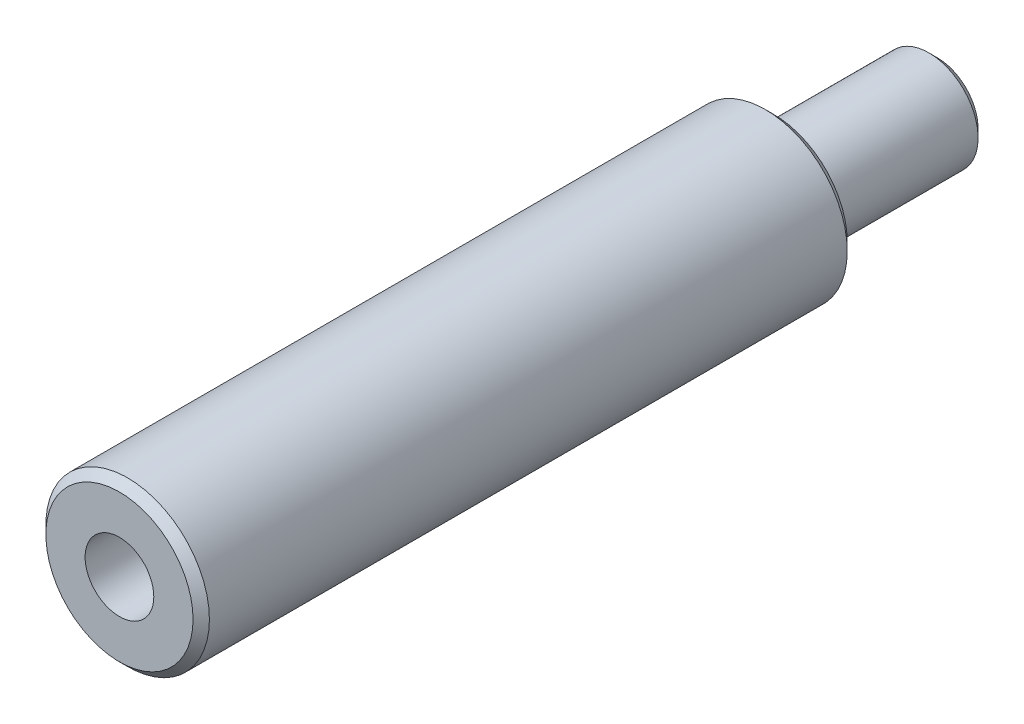
ISO-10303-21;
HEADER;
FILE_DESCRIPTION(('STEP AP214'),'2;1');
FILE_NAME('part.step','',(''),(''),'','','');
FILE_SCHEMA(('AUTOMOTIVE_DESIGN { 1 0 10303 214 1 1 1 1 }'));
ENDSEC;
DATA;
#1=APPLICATION_CONTEXT('core data for automotive mechanical design processes');
#2=APPLICATION_PROTOCOL_DEFINITION('international standard','automotive_design',2000,#1);
#3=PRODUCT_CONTEXT('',#1,'mechanical');
#4=PRODUCT('Part','Part','',(#3));
#5=PRODUCT_RELATED_PRODUCT_CATEGORY('part','',(#4));
#6=PRODUCT_DEFINITION_FORMATION('','',#4);
#7=PRODUCT_DEFINITION_CONTEXT('part definition',#1,'design');
#8=PRODUCT_DEFINITION('design','',#6,#7);
#9=PRODUCT_DEFINITION_SHAPE('','',#8);
#10=(LENGTH_UNIT() NAMED_UNIT(*) SI_UNIT(.MILLI.,.METRE.));
#11=(NAMED_UNIT(*) PLANE_ANGLE_UNIT() SI_UNIT($,.RADIAN.));
#12=(NAMED_UNIT(*) SI_UNIT($,.STERADIAN.) SOLID_ANGLE_UNIT());
#13=UNCERTAINTY_MEASURE_WITH_UNIT(LENGTH_MEASURE(1.E-05),#10,'distance_accuracy_value','');
#14=(GEOMETRIC_REPRESENTATION_CONTEXT(3) GLOBAL_UNCERTAINTY_ASSIGNED_CONTEXT((#13)) GLOBAL_UNIT_ASSIGNED_CONTEXT((#10,
#11,#12)) REPRESENTATION_CONTEXT('',''));
#15=CARTESIAN_POINT('',(0.,0.,0.));
#16=DIRECTION('',(0.,0.,1.));
#17=DIRECTION('',(1.,0.,0.));
#18=AXIS2_PLACEMENT_3D('',#15,#16,#17);
#19=CARTESIAN_POINT('',(0.,0.,40.));
#20=DIRECTION('',(0.,0.,-1.));
#21=DIRECTION('',(-1.,0.,0.));
#22=AXIS2_PLACEMENT_3D('',#19,#20,#21);
#23=CYLINDRICAL_SURFACE('',#22,5.);
#24=CARTESIAN_POINT('',(0.,0.,0.500000000000007));
#25=DIRECTION('',(0.,0.,1.));
#26=DIRECTION('',(1.,0.,0.));
#27=AXIS2_PLACEMENT_3D('',#24,#25,#26);
#28=CIRCLE('',#27,5.);
#29=CARTESIAN_POINT('',(5.,0.,0.500000000000007));
#30=VERTEX_POINT('',#29);
#31=EDGE_CURVE('E71',#30,#30,#28,.T.);
#32=ORIENTED_EDGE('',*,*,#31,.T.);
#33=EDGE_LOOP('',(#32));
#34=FACE_BOUND('',#33,.T.);
#35=CARTESIAN_POINT('',(0.,0.,39.5));
#36=DIRECTION('',(0.,0.,1.));
#37=DIRECTION('',(1.,0.,0.));
#38=AXIS2_PLACEMENT_3D('',#35,#36,#37);
#39=CIRCLE('',#38,5.);
#40=CARTESIAN_POINT('',(5.,0.,39.5));
#41=VERTEX_POINT('',#40);
#42=EDGE_CURVE('E68',#41,#41,#39,.F.);
#43=ORIENTED_EDGE('',*,*,#42,.T.);
#44=EDGE_LOOP('',(#43));
#45=FACE_BOUND('',#44,.T.);
#46=ADVANCED_FACE('F34',(#34,#45),#23,.T.);
#47=CARTESIAN_POINT('',(0.,0.,40.));
#48=DIRECTION('',(0.,0.,1.));
#49=DIRECTION('',(1.,0.,0.));
#50=AXIS2_PLACEMENT_3D('',#47,#48,#49);
#51=PLANE('',#50);
#52=CARTESIAN_POINT('',(0.,0.,40.));
#53=DIRECTION('',(0.,0.,1.));
#54=DIRECTION('',(1.,0.,0.));
#55=AXIS2_PLACEMENT_3D('',#52,#53,#54);
#56=CIRCLE('',#55,4.5);
#57=CARTESIAN_POINT('',(4.5,0.,40.));
#58=VERTEX_POINT('',#57);
#59=EDGE_CURVE('E11',#58,#58,#56,.T.);
#60=ORIENTED_EDGE('',*,*,#59,.T.);
#61=EDGE_LOOP('',(#60));
#62=FACE_BOUND('',#61,.T.);
#63=CARTESIAN_POINT('',(0.,0.,40.));
#64=DIRECTION('',(0.,0.,1.));
#65=DIRECTION('',(1.,0.,0.));
#66=AXIS2_PLACEMENT_3D('',#63,#64,#65);
#67=CIRCLE('',#66,2.1);
#68=CARTESIAN_POINT('',(2.1,0.,40.));
#69=VERTEX_POINT('',#68);
#70=EDGE_CURVE('E55',#69,#69,#67,.T.);
#71=ORIENTED_EDGE('',*,*,#70,.F.);
#72=EDGE_LOOP('',(#71));
#73=FACE_BOUND('',#72,.T.);
#74=ADVANCED_FACE('F87',(#62,#73),#51,.T.);
#75=CARTESIAN_POINT('',(0.,0.,0.));
#76=DIRECTION('',(0.,0.,1.));
#77=DIRECTION('',(1.,0.,0.));
#78=AXIS2_PLACEMENT_3D('',#75,#76,#77);
#79=PLANE('',#78);
#80=CARTESIAN_POINT('',(0.,0.,0.));
#81=DIRECTION('',(0.,0.,1.));
#82=DIRECTION('',(1.,0.,0.));
#83=AXIS2_PLACEMENT_3D('',#80,#81,#82);
#84=CIRCLE('',#83,4.49999999999999);
#85=CARTESIAN_POINT('',(4.49999999999999,0.,0.));
#86=VERTEX_POINT('',#85);
#87=EDGE_CURVE('E41',#86,#86,#84,.F.);
#88=ORIENTED_EDGE('',*,*,#87,.T.);
#89=EDGE_LOOP('',(#88));
#90=FACE_BOUND('',#89,.T.);
#91=CARTESIAN_POINT('',(0.,0.,0.));
#92=DIRECTION('',(0.,0.,-1.));
#93=DIRECTION('',(-1.,0.,0.));
#94=AXIS2_PLACEMENT_3D('',#91,#92,#93);
#95=CIRCLE('',#94,3.);
#96=CARTESIAN_POINT('',(-3.,0.,0.));
#97=VERTEX_POINT('',#96);
#98=EDGE_CURVE('E54',#97,#97,#95,.T.);
#99=ORIENTED_EDGE('',*,*,#98,.F.);
#100=EDGE_LOOP('',(#99));
#101=FACE_BOUND('',#100,.T.);
#102=ADVANCED_FACE('F76',(#90,#101),#79,.F.);
#103=CARTESIAN_POINT('',(0.,0.,-10.));
#104=DIRECTION('',(0.,0.,1.));
#105=DIRECTION('',(1.,0.,0.));
#106=AXIS2_PLACEMENT_3D('',#103,#104,#105);
#107=CYLINDRICAL_SURFACE('',#106,3.);
#108=CARTESIAN_POINT('',(0.,0.,-9.5));
#109=DIRECTION('',(0.,0.,-1.));
#110=DIRECTION('',(-1.,0.,0.));
#111=AXIS2_PLACEMENT_3D('',#108,#109,#110);
#112=CIRCLE('',#111,3.);
#113=CARTESIAN_POINT('',(-3.,0.,-9.5));
#114=VERTEX_POINT('',#113);
#115=EDGE_CURVE('E65',#114,#114,#112,.F.);
#116=ORIENTED_EDGE('',*,*,#115,.T.);
#117=EDGE_LOOP('',(#116));
#118=FACE_BOUND('',#117,.T.);
#119=ORIENTED_EDGE('',*,*,#98,.T.);
#120=EDGE_LOOP('',(#119));
#121=FACE_BOUND('',#120,.T.);
#122=ADVANCED_FACE('F110',(#118,#121),#107,.T.);
#123=CARTESIAN_POINT('',(0.,0.,-10.));
#124=DIRECTION('',(0.,0.,-1.));
#125=DIRECTION('',(-1.,0.,0.));
#126=AXIS2_PLACEMENT_3D('',#123,#124,#125);
#127=PLANE('',#126);
#128=CARTESIAN_POINT('',(0.,0.,-10.));
#129=DIRECTION('',(0.,0.,-1.));
#130=DIRECTION('',(-1.,0.,0.));
#131=AXIS2_PLACEMENT_3D('',#128,#129,#130);
#132=CIRCLE('',#131,2.5);
#133=CARTESIAN_POINT('',(-2.5,0.,-10.));
#134=VERTEX_POINT('',#133);
#135=EDGE_CURVE('E58',#134,#134,#132,.T.);
#136=ORIENTED_EDGE('',*,*,#135,.T.);
#137=EDGE_LOOP('',(#136));
#138=FACE_BOUND('',#137,.T.);
#139=ADVANCED_FACE('F48',(#138),#127,.T.);
#140=CARTESIAN_POINT('',(0.,0.,30.));
#141=DIRECTION('',(0.,0.,1.));
#142=DIRECTION('',(1.,0.,0.));
#143=AXIS2_PLACEMENT_3D('',#140,#141,#142);
#144=CONICAL_SURFACE('',#143,2.1,1.02974425867665);
#145=CARTESIAN_POINT('',(0.,0.,28.7381927000421));
#146=VERTEX_POINT('',#145);
#147=VERTEX_LOOP('',#146);
#148=FACE_BOUND('',#147,.T.);
#149=CARTESIAN_POINT('',(0.,0.,30.));
#150=DIRECTION('',(0.,0.,1.));
#151=DIRECTION('',(1.,0.,0.));
#152=AXIS2_PLACEMENT_3D('',#149,#150,#151);
#153=CIRCLE('',#152,2.1);
#154=CARTESIAN_POINT('',(2.1,0.,30.));
#155=VERTEX_POINT('',#154);
#156=EDGE_CURVE('E52',#155,#155,#153,.T.);
#157=ORIENTED_EDGE('',*,*,#156,.T.);
#158=EDGE_LOOP('',(#157));
#159=FACE_BOUND('',#158,.T.);
#160=ADVANCED_FACE('F44',(#148,#159),#144,.F.);
#161=CARTESIAN_POINT('',(0.,0.,40.));
#162=DIRECTION('',(0.,0.,1.));
#163=DIRECTION('',(1.,0.,0.));
#164=AXIS2_PLACEMENT_3D('',#161,#162,#163);
#165=CYLINDRICAL_SURFACE('',#164,2.1);
#166=ORIENTED_EDGE('',*,*,#156,.F.);
#167=EDGE_LOOP('',(#166));
#168=FACE_BOUND('',#167,.T.);
#169=ORIENTED_EDGE('',*,*,#70,.T.);
#170=EDGE_LOOP('',(#169));
#171=FACE_BOUND('',#170,.T.);
#172=ADVANCED_FACE('F47',(#168,#171),#165,.F.);
#173=CARTESIAN_POINT('',(0.,0.,-10.));
#174=DIRECTION('',(0.,0.,1.));
#175=DIRECTION('',(1.,0.,0.));
#176=AXIS2_PLACEMENT_3D('',#173,#174,#175);
#177=CONICAL_SURFACE('',#176,2.5,0.785398163397445);
#178=ORIENTED_EDGE('',*,*,#115,.F.);
#179=EDGE_LOOP('',(#178));
#180=FACE_BOUND('',#179,.T.);
#181=ORIENTED_EDGE('',*,*,#135,.F.);
#182=EDGE_LOOP('',(#181));
#183=FACE_BOUND('',#182,.T.);
#184=ADVANCED_FACE('F82',(#180,#183),#177,.T.);
#185=CARTESIAN_POINT('',(0.,0.,0.500000000000007));
#186=DIRECTION('',(0.,0.,1.));
#187=DIRECTION('',(1.,0.,0.));
#188=AXIS2_PLACEMENT_3D('',#185,#186,#187);
#189=CONICAL_SURFACE('',#188,5.,0.785398163397451);
#190=ORIENTED_EDGE('',*,*,#87,.F.);
#191=EDGE_LOOP('',(#190));
#192=FACE_BOUND('',#191,.T.);
#193=ORIENTED_EDGE('',*,*,#31,.F.);
#194=EDGE_LOOP('',(#193));
#195=FACE_BOUND('',#194,.T.);
#196=ADVANCED_FACE('F79',(#192,#195),#189,.T.);
#197=CARTESIAN_POINT('',(0.,0.,40.));
#198=DIRECTION('',(0.,0.,-1.));
#199=DIRECTION('',(-1.,0.,0.));
#200=AXIS2_PLACEMENT_3D('',#197,#198,#199);
#201=CONICAL_SURFACE('',#200,4.5,0.785398163397451);
#202=ORIENTED_EDGE('',*,*,#42,.F.);
#203=EDGE_LOOP('',(#202));
#204=FACE_BOUND('',#203,.T.);
#205=ORIENTED_EDGE('',*,*,#59,.F.);
#206=EDGE_LOOP('',(#205));
#207=FACE_BOUND('',#206,.T.);
#208=ADVANCED_FACE('F36',(#204,#207),#201,.T.);
#209=CLOSED_SHELL('',(#46,#74,#102,#122,#139,#160,#172,#184,#196,#208));
#210=MANIFOLD_SOLID_BREP('B2',#209);
#211=ADVANCED_BREP_SHAPE_REPRESENTATION('',(#18,#210),#14);
#212=SHAPE_DEFINITION_REPRESENTATION(#9,#211);
ENDSEC;
END-ISO-10303-21;
